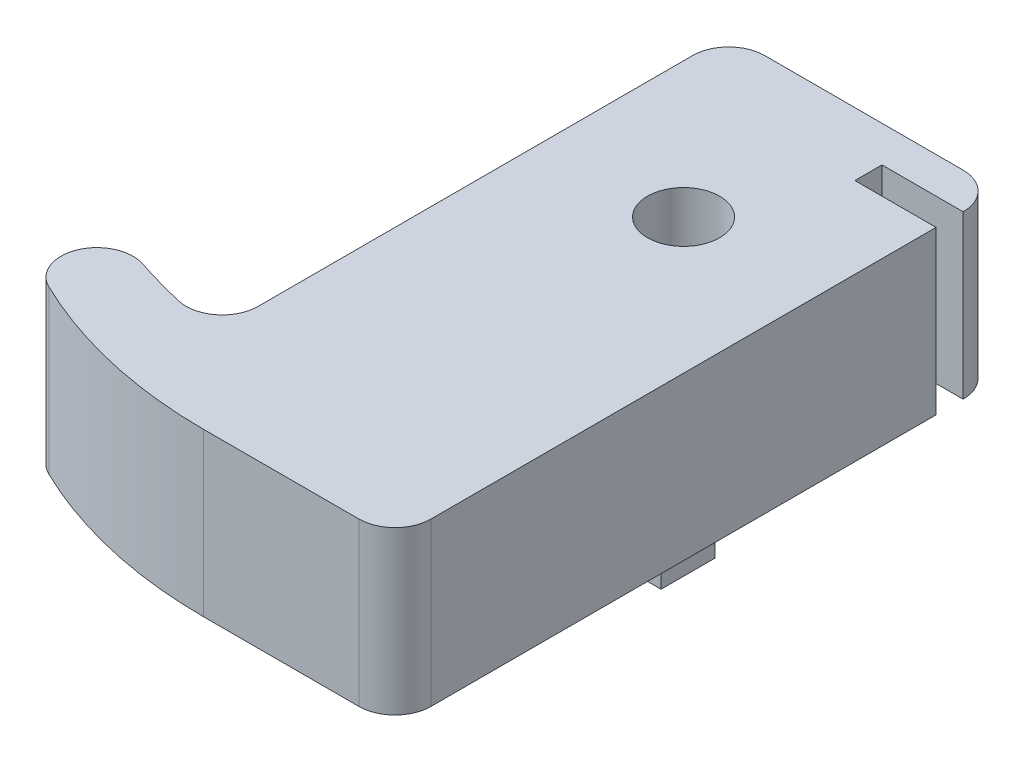
ISO-10303-21;
HEADER;
FILE_DESCRIPTION(('STEP AP214'),'2;1');
FILE_NAME('part.step','',(''),(''),'','','');
FILE_SCHEMA(('AUTOMOTIVE_DESIGN { 1 0 10303 214 1 1 1 1 }'));
ENDSEC;
DATA;
#1=APPLICATION_CONTEXT('core data for automotive mechanical design processes');
#2=APPLICATION_PROTOCOL_DEFINITION('international standard','automotive_design',2000,#1);
#3=PRODUCT_CONTEXT('',#1,'mechanical');
#4=PRODUCT('Part','Part','',(#3));
#5=PRODUCT_RELATED_PRODUCT_CATEGORY('part','',(#4));
#6=PRODUCT_DEFINITION_FORMATION('','',#4);
#7=PRODUCT_DEFINITION_CONTEXT('part definition',#1,'design');
#8=PRODUCT_DEFINITION('design','',#6,#7);
#9=PRODUCT_DEFINITION_SHAPE('','',#8);
#10=(LENGTH_UNIT() NAMED_UNIT(*) SI_UNIT(.MILLI.,.METRE.));
#11=(NAMED_UNIT(*) PLANE_ANGLE_UNIT() SI_UNIT($,.RADIAN.));
#12=(NAMED_UNIT(*) SI_UNIT($,.STERADIAN.) SOLID_ANGLE_UNIT());
#13=UNCERTAINTY_MEASURE_WITH_UNIT(LENGTH_MEASURE(1.E-05),#10,'distance_accuracy_value','');
#14=(GEOMETRIC_REPRESENTATION_CONTEXT(3) GLOBAL_UNCERTAINTY_ASSIGNED_CONTEXT((#13)) GLOBAL_UNIT_ASSIGNED_CONTEXT((#10,
#11,#12)) REPRESENTATION_CONTEXT('',''));
#15=CARTESIAN_POINT('',(0.,0.,0.));
#16=DIRECTION('',(0.,0.,1.));
#17=DIRECTION('',(1.,0.,0.));
#18=AXIS2_PLACEMENT_3D('',#15,#16,#17);
#19=CARTESIAN_POINT('',(0.,9.,-25.5));
#20=DIRECTION('',(0.,-1.,0.));
#21=DIRECTION('',(0.,0.,-1.));
#22=AXIS2_PLACEMENT_3D('',#19,#20,#21);
#23=CYLINDRICAL_SURFACE('',#22,25.5);
#24=CARTESIAN_POINT('',(0.,0.,-25.5));
#25=DIRECTION('',(0.,1.,0.));
#26=DIRECTION('',(0.,0.,1.));
#27=AXIS2_PLACEMENT_3D('',#24,#25,#26);
#28=CIRCLE('',#27,25.5);
#29=CARTESIAN_POINT('',(-11.1311224151511,0.,-2.55772213186054));
#30=VERTEX_POINT('',#29);
#31=CARTESIAN_POINT('',(0.,0.,0.));
#32=VERTEX_POINT('',#31);
#33=EDGE_CURVE('E335',#30,#32,#28,.T.);
#34=ORIENTED_EDGE('',*,*,#33,.F.);
#35=DIRECTION('',(0.,-1.,0.));
#36=VECTOR('',#35,1.);
#37=CARTESIAN_POINT('',(-11.1311224151511,9.,-2.55772213186054));
#38=LINE('',#37,#36);
#39=CARTESIAN_POINT('',(-11.1311224151511,-9.,-2.55772213186054));
#40=VERTEX_POINT('',#39);
#41=EDGE_CURVE('E234',#30,#40,#38,.T.);
#42=ORIENTED_EDGE('',*,*,#41,.T.);
#43=CARTESIAN_POINT('',(0.,-9.,-25.5));
#44=DIRECTION('',(0.,1.,0.));
#45=DIRECTION('',(0.,0.,-1.));
#46=AXIS2_PLACEMENT_3D('',#43,#44,#45);
#47=CIRCLE('',#46,25.5);
#48=CARTESIAN_POINT('',(0.,-9.,0.));
#49=VERTEX_POINT('',#48);
#50=EDGE_CURVE('E277',#40,#49,#47,.T.);
#51=ORIENTED_EDGE('',*,*,#50,.T.);
#52=DIRECTION('',(0.,-1.,0.));
#53=VECTOR('',#52,1.);
#54=CARTESIAN_POINT('',(0.,9.,0.));
#55=LINE('',#54,#53);
#56=EDGE_CURVE('E47',#32,#49,#55,.T.);
#57=ORIENTED_EDGE('',*,*,#56,.F.);
#58=EDGE_LOOP('',(#34,#42,#51,#57));
#59=FACE_BOUND('',#58,.T.);
#60=ADVANCED_FACE('F39',(#59),#23,.T.);
#61=CARTESIAN_POINT('',(8.61716411489142,9.,0.));
#62=DIRECTION('',(0.,0.,-1.));
#63=DIRECTION('',(-1.,0.,0.));
#64=AXIS2_PLACEMENT_3D('',#61,#62,#63);
#65=PLANE('',#64);
#66=DIRECTION('',(1.,0.,0.));
#67=VECTOR('',#66,1.);
#68=CARTESIAN_POINT('',(8.61716411489142,0.,0.));
#69=LINE('',#68,#67);
#70=CARTESIAN_POINT('',(8.61716411489143,0.,0.));
#71=VERTEX_POINT('',#70);
#72=EDGE_CURVE('E273',#32,#71,#69,.T.);
#73=ORIENTED_EDGE('',*,*,#72,.F.);
#74=ORIENTED_EDGE('',*,*,#56,.T.);
#75=DIRECTION('',(1.,0.,0.));
#76=VECTOR('',#75,1.);
#77=CARTESIAN_POINT('',(8.61716411489142,-9.,0.));
#78=LINE('',#77,#76);
#79=CARTESIAN_POINT('',(8.61716411489142,-9.,0.));
#80=VERTEX_POINT('',#79);
#81=EDGE_CURVE('E271',#49,#80,#78,.T.);
#82=ORIENTED_EDGE('',*,*,#81,.T.);
#83=DIRECTION('',(0.,-1.,0.));
#84=VECTOR('',#83,1.);
#85=CARTESIAN_POINT('',(8.61716411489142,9.,0.));
#86=LINE('',#85,#84);
#87=EDGE_CURVE('E260',#71,#80,#86,.T.);
#88=ORIENTED_EDGE('',*,*,#87,.F.);
#89=EDGE_LOOP('',(#73,#74,#82,#88));
#90=FACE_BOUND('',#89,.T.);
#91=ADVANCED_FACE('F268',(#90),#65,.F.);
#92=CARTESIAN_POINT('',(8.61716411489143,9.,-2.));
#93=DIRECTION('',(0.,-1.,0.));
#94=DIRECTION('',(0.,0.,-1.));
#95=AXIS2_PLACEMENT_3D('',#92,#93,#94);
#96=CYLINDRICAL_SURFACE('',#95,2.);
#97=CARTESIAN_POINT('',(8.61716411489143,0.,-2.));
#98=DIRECTION('',(0.,1.,0.));
#99=DIRECTION('',(0.,0.,1.));
#100=AXIS2_PLACEMENT_3D('',#97,#98,#99);
#101=CIRCLE('',#100,2.);
#102=CARTESIAN_POINT('',(10.6171641148914,0.,-2.00000000000002));
#103=VERTEX_POINT('',#102);
#104=EDGE_CURVE('E598',#71,#103,#101,.T.);
#105=ORIENTED_EDGE('',*,*,#104,.F.);
#106=ORIENTED_EDGE('',*,*,#87,.T.);
#107=CARTESIAN_POINT('',(8.61716411489143,-9.,-2.));
#108=DIRECTION('',(0.,1.,0.));
#109=DIRECTION('',(0.,0.,-1.));
#110=AXIS2_PLACEMENT_3D('',#107,#108,#109);
#111=CIRCLE('',#110,2.);
#112=CARTESIAN_POINT('',(10.6171641148914,-9.,-2.00000000000001));
#113=VERTEX_POINT('',#112);
#114=EDGE_CURVE('E289',#80,#113,#111,.T.);
#115=ORIENTED_EDGE('',*,*,#114,.T.);
#116=DIRECTION('',(0.,-1.,0.));
#117=VECTOR('',#116,1.);
#118=CARTESIAN_POINT('',(10.6171641148914,9.,-2.00000000000001));
#119=LINE('',#118,#117);
#120=EDGE_CURVE('E257',#103,#113,#119,.T.);
#121=ORIENTED_EDGE('',*,*,#120,.F.);
#122=EDGE_LOOP('',(#105,#106,#115,#121));
#123=FACE_BOUND('',#122,.T.);
#124=ADVANCED_FACE('F495',(#123),#96,.T.);
#125=CARTESIAN_POINT('',(10.6171641148914,9.,-31.5));
#126=DIRECTION('',(-1.,0.,0.));
#127=DIRECTION('',(0.,0.,1.));
#128=AXIS2_PLACEMENT_3D('',#125,#126,#127);
#129=PLANE('',#128);
#130=DIRECTION('',(0.,0.,-1.));
#131=VECTOR('',#130,1.);
#132=CARTESIAN_POINT('',(10.6171641148914,0.,-31.5));
#133=LINE('',#132,#131);
#134=CARTESIAN_POINT('',(10.6171641148914,0.,-30.));
#135=VERTEX_POINT('',#134);
#136=EDGE_CURVE('E595',#103,#135,#133,.T.);
#137=ORIENTED_EDGE('',*,*,#136,.F.);
#138=ORIENTED_EDGE('',*,*,#120,.T.);
#139=DIRECTION('',(0.,0.,-1.));
#140=VECTOR('',#139,1.);
#141=CARTESIAN_POINT('',(10.6171641148914,-9.,-31.5));
#142=LINE('',#141,#140);
#143=CARTESIAN_POINT('',(10.6171641148914,-9.,-30.));
#144=VERTEX_POINT('',#143);
#145=EDGE_CURVE('E293',#113,#144,#142,.T.);
#146=ORIENTED_EDGE('',*,*,#145,.T.);
#147=DIRECTION('',(0.,1.,0.));
#148=VECTOR('',#147,1.);
#149=CARTESIAN_POINT('',(10.6171641148914,-0.000999999999999265,-30.));
#150=LINE('',#149,#148);
#151=EDGE_CURVE('E225',#144,#135,#150,.T.);
#152=ORIENTED_EDGE('',*,*,#151,.T.);
#153=EDGE_LOOP('',(#137,#138,#146,#152));
#154=FACE_BOUND('',#153,.T.);
#155=ADVANCED_FACE('F499',(#154),#129,.F.);
#156=CARTESIAN_POINT('',(8.61716411489142,9.,-31.5));
#157=DIRECTION('',(0.,-1.,0.));
#158=DIRECTION('',(0.,0.,-1.));
#159=AXIS2_PLACEMENT_3D('',#156,#157,#158);
#160=CYLINDRICAL_SURFACE('',#159,2.);
#161=CARTESIAN_POINT('',(8.61716411489142,0.,-31.5));
#162=DIRECTION('',(0.,1.,0.));
#163=DIRECTION('',(0.,0.,1.));
#164=AXIS2_PLACEMENT_3D('',#161,#162,#163);
#165=CIRCLE('',#164,2.);
#166=CARTESIAN_POINT('',(10.6171641148914,0.,-31.5));
#167=VERTEX_POINT('',#166);
#168=CARTESIAN_POINT('',(8.61716411489142,0.,-33.5));
#169=VERTEX_POINT('',#168);
#170=EDGE_CURVE('E213',#167,#169,#165,.T.);
#171=ORIENTED_EDGE('',*,*,#170,.F.);
#172=DIRECTION('',(0.,-1.,0.));
#173=VECTOR('',#172,1.);
#174=CARTESIAN_POINT('',(10.6171641148914,9.,-31.5));
#175=LINE('',#174,#173);
#176=CARTESIAN_POINT('',(10.6171641148914,-9.,-31.5));
#177=VERTEX_POINT('',#176);
#178=EDGE_CURVE('E211',#167,#177,#175,.T.);
#179=ORIENTED_EDGE('',*,*,#178,.T.);
#180=CARTESIAN_POINT('',(8.61716411489142,-9.,-31.5));
#181=DIRECTION('',(0.,1.,0.));
#182=DIRECTION('',(0.,0.,-1.));
#183=AXIS2_PLACEMENT_3D('',#180,#181,#182);
#184=CIRCLE('',#183,2.);
#185=CARTESIAN_POINT('',(8.61716411489142,-9.,-33.5));
#186=VERTEX_POINT('',#185);
#187=EDGE_CURVE('E300',#177,#186,#184,.T.);
#188=ORIENTED_EDGE('',*,*,#187,.T.);
#189=DIRECTION('',(0.,-1.,0.));
#190=VECTOR('',#189,1.);
#191=CARTESIAN_POINT('',(8.61716411489142,9.,-33.5));
#192=LINE('',#191,#190);
#193=EDGE_CURVE('E252',#169,#186,#192,.T.);
#194=ORIENTED_EDGE('',*,*,#193,.F.);
#195=EDGE_LOOP('',(#171,#179,#188,#194));
#196=FACE_BOUND('',#195,.T.);
#197=ADVANCED_FACE('F505',(#196),#160,.T.);
#198=CARTESIAN_POINT('',(-2.38283588510858,9.,-33.5));
#199=DIRECTION('',(0.,0.,1.));
#200=DIRECTION('',(1.,0.,0.));
#201=AXIS2_PLACEMENT_3D('',#198,#199,#200);
#202=PLANE('',#201);
#203=DIRECTION('',(-1.,0.,0.));
#204=VECTOR('',#203,1.);
#205=CARTESIAN_POINT('',(-2.38283588510858,0.,-33.5));
#206=LINE('',#205,#204);
#207=CARTESIAN_POINT('',(-2.38283588510858,0.,-33.5));
#208=VERTEX_POINT('',#207);
#209=EDGE_CURVE('E352',#169,#208,#206,.T.);
#210=ORIENTED_EDGE('',*,*,#209,.F.);
#211=ORIENTED_EDGE('',*,*,#193,.T.);
#212=DIRECTION('',(-1.,0.,0.));
#213=VECTOR('',#212,1.);
#214=CARTESIAN_POINT('',(-2.38283588510858,-9.,-33.5));
#215=LINE('',#214,#213);
#216=CARTESIAN_POINT('',(-2.38283588510858,-9.,-33.5));
#217=VERTEX_POINT('',#216);
#218=EDGE_CURVE('E304',#186,#217,#215,.T.);
#219=ORIENTED_EDGE('',*,*,#218,.T.);
#220=DIRECTION('',(0.,-1.,0.));
#221=VECTOR('',#220,1.);
#222=CARTESIAN_POINT('',(-2.38283588510858,9.,-33.5));
#223=LINE('',#222,#221);
#224=EDGE_CURVE('E249',#208,#217,#223,.T.);
#225=ORIENTED_EDGE('',*,*,#224,.F.);
#226=EDGE_LOOP('',(#210,#211,#219,#225));
#227=FACE_BOUND('',#226,.T.);
#228=ADVANCED_FACE('F509',(#227),#202,.F.);
#229=CARTESIAN_POINT('',(-2.38283588510858,9.,-31.5));
#230=DIRECTION('',(0.,-1.,0.));
#231=DIRECTION('',(0.,0.,-1.));
#232=AXIS2_PLACEMENT_3D('',#229,#230,#231);
#233=CYLINDRICAL_SURFACE('',#232,2.);
#234=CARTESIAN_POINT('',(-2.38283588510858,0.,-31.5));
#235=DIRECTION('',(0.,1.,0.));
#236=DIRECTION('',(0.,0.,1.));
#237=AXIS2_PLACEMENT_3D('',#234,#235,#236);
#238=CIRCLE('',#237,2.);
#239=CARTESIAN_POINT('',(-4.38283588510858,0.,-31.5));
#240=VERTEX_POINT('',#239);
#241=EDGE_CURVE('E349',#208,#240,#238,.T.);
#242=ORIENTED_EDGE('',*,*,#241,.F.);
#243=ORIENTED_EDGE('',*,*,#224,.T.);
#244=CARTESIAN_POINT('',(-2.38283588510858,-9.,-31.5));
#245=DIRECTION('',(0.,1.,0.));
#246=DIRECTION('',(0.,0.,1.));
#247=AXIS2_PLACEMENT_3D('',#244,#245,#246);
#248=CIRCLE('',#247,2.);
#249=CARTESIAN_POINT('',(-4.38283588510858,-9.,-31.5));
#250=VERTEX_POINT('',#249);
#251=EDGE_CURVE('E308',#217,#250,#248,.T.);
#252=ORIENTED_EDGE('',*,*,#251,.T.);
#253=DIRECTION('',(0.,-1.,0.));
#254=VECTOR('',#253,1.);
#255=CARTESIAN_POINT('',(-4.38283588510858,9.,-31.5));
#256=LINE('',#255,#254);
#257=EDGE_CURVE('E246',#240,#250,#256,.T.);
#258=ORIENTED_EDGE('',*,*,#257,.F.);
#259=EDGE_LOOP('',(#242,#243,#252,#258));
#260=FACE_BOUND('',#259,.T.);
#261=ADVANCED_FACE('F513',(#260),#233,.T.);
#262=CARTESIAN_POINT('',(-4.38283588510857,9.,-7.42105961310574));
#263=DIRECTION('',(1.,0.,0.));
#264=DIRECTION('',(0.,0.,-1.));
#265=AXIS2_PLACEMENT_3D('',#262,#263,#264);
#266=PLANE('',#265);
#267=DIRECTION('',(0.,0.,1.));
#268=VECTOR('',#267,1.);
#269=CARTESIAN_POINT('',(-4.38283588510857,0.,-7.42105961310574));
#270=LINE('',#269,#268);
#271=CARTESIAN_POINT('',(-4.38283588510857,0.,-7.42105961310574));
#272=VERTEX_POINT('',#271);
#273=EDGE_CURVE('E346',#240,#272,#270,.T.);
#274=ORIENTED_EDGE('',*,*,#273,.F.);
#275=ORIENTED_EDGE('',*,*,#257,.T.);
#276=DIRECTION('',(0.,0.,1.));
#277=VECTOR('',#276,1.);
#278=CARTESIAN_POINT('',(-4.38283588510857,-9.,-7.42105961310574));
#279=LINE('',#278,#277);
#280=CARTESIAN_POINT('',(-4.38283588510857,-9.,-7.42105961310574));
#281=VERTEX_POINT('',#280);
#282=EDGE_CURVE('E312',#250,#281,#279,.T.);
#283=ORIENTED_EDGE('',*,*,#282,.T.);
#284=DIRECTION('',(0.,-1.,0.));
#285=VECTOR('',#284,1.);
#286=CARTESIAN_POINT('',(-4.38283588510857,9.,-7.42105961310574));
#287=LINE('',#286,#285);
#288=EDGE_CURVE('E243',#272,#281,#287,.T.);
#289=ORIENTED_EDGE('',*,*,#288,.F.);
#290=EDGE_LOOP('',(#274,#275,#283,#289));
#291=FACE_BOUND('',#290,.T.);
#292=ADVANCED_FACE('F517',(#291),#266,.F.);
#293=CARTESIAN_POINT('',(-6.38283588510857,9.,-7.42105961310574));
#294=DIRECTION('',(0.,-1.,0.));
#295=DIRECTION('',(0.,0.,-1.));
#296=AXIS2_PLACEMENT_3D('',#293,#294,#295);
#297=CYLINDRICAL_SURFACE('',#296,2.);
#298=CARTESIAN_POINT('',(-6.38283588510857,0.,-7.42105961310574));
#299=DIRECTION('',(0.,1.,0.));
#300=DIRECTION('',(0.,0.,1.));
#301=AXIS2_PLACEMENT_3D('',#298,#299,#300);
#302=CIRCLE('',#301,2.);
#303=CARTESIAN_POINT('',(-6.83639449681552,0.,-5.47316726860966));
#304=VERTEX_POINT('',#303);
#305=EDGE_CURVE('E339',#272,#304,#302,.F.);
#306=ORIENTED_EDGE('',*,*,#305,.F.);
#307=ORIENTED_EDGE('',*,*,#288,.T.);
#308=CARTESIAN_POINT('',(-6.38283588510857,-9.,-7.42105961310574));
#309=DIRECTION('',(0.,-1.,0.));
#310=DIRECTION('',(0.,0.,1.));
#311=AXIS2_PLACEMENT_3D('',#308,#309,#310);
#312=CIRCLE('',#311,2.);
#313=CARTESIAN_POINT('',(-6.83639449681552,-9.,-5.47316726860966));
#314=VERTEX_POINT('',#313);
#315=EDGE_CURVE('E316',#281,#314,#312,.T.);
#316=ORIENTED_EDGE('',*,*,#315,.T.);
#317=DIRECTION('',(0.,-1.,0.));
#318=VECTOR('',#317,1.);
#319=CARTESIAN_POINT('',(-6.83639449681552,9.,-5.47316726860966));
#320=LINE('',#319,#318);
#321=EDGE_CURVE('E240',#304,#314,#320,.T.);
#322=ORIENTED_EDGE('',*,*,#321,.F.);
#323=EDGE_LOOP('',(#306,#307,#316,#322));
#324=FACE_BOUND('',#323,.T.);
#325=ADVANCED_FACE('F521',(#324),#297,.F.);
#326=CARTESIAN_POINT('',(0.571114599262993,9.,-37.2861014464734));
#327=DIRECTION('',(0.,-1.,0.));
#328=DIRECTION('',(0.,0.,-1.));
#329=AXIS2_PLACEMENT_3D('',#326,#327,#328);
#330=CYLINDRICAL_SURFACE('',#329,32.6639552414213);
#331=CARTESIAN_POINT('',(0.571114599262993,0.,-37.2861014464734));
#332=DIRECTION('',(0.,1.,0.));
#333=DIRECTION('',(0.,0.,1.));
#334=AXIS2_PLACEMENT_3D('',#331,#332,#333);
#335=CIRCLE('',#334,32.6639552414213);
#336=CARTESIAN_POINT('',(-9.63328234827252,0.,-6.25701420642225));
#337=VERTEX_POINT('',#336);
#338=EDGE_CURVE('E334',#304,#337,#335,.F.);
#339=ORIENTED_EDGE('',*,*,#338,.F.);
#340=ORIENTED_EDGE('',*,*,#321,.T.);
#341=CARTESIAN_POINT('',(0.571114599262993,-9.,-37.2861014464734));
#342=DIRECTION('',(0.,-1.,0.));
#343=DIRECTION('',(0.,0.,-1.));
#344=AXIS2_PLACEMENT_3D('',#341,#342,#343);
#345=CIRCLE('',#344,32.6639552414213);
#346=CARTESIAN_POINT('',(-9.63328234827252,-9.,-6.25701420642225));
#347=VERTEX_POINT('',#346);
#348=EDGE_CURVE('E228',#314,#347,#345,.T.);
#349=ORIENTED_EDGE('',*,*,#348,.T.);
#350=DIRECTION('',(0.,-1.,0.));
#351=VECTOR('',#350,1.);
#352=CARTESIAN_POINT('',(-9.63328234827252,9.,-6.25701420642225));
#353=LINE('',#352,#351);
#354=EDGE_CURVE('E237',#337,#347,#353,.T.);
#355=ORIENTED_EDGE('',*,*,#354,.F.);
#356=EDGE_LOOP('',(#339,#340,#349,#355));
#357=FACE_BOUND('',#356,.T.);
#358=ADVANCED_FACE('F326',(#357),#330,.F.);
#359=CARTESIAN_POINT('',(-10.2580932061196,9.,-4.35711647445971));
#360=DIRECTION('',(0.,-1.,0.));
#361=DIRECTION('',(0.,0.,-1.));
#362=AXIS2_PLACEMENT_3D('',#359,#360,#361);
#363=CYLINDRICAL_SURFACE('',#362,2.);
#364=CARTESIAN_POINT('',(-10.2580932061196,0.,-4.35711647445971));
#365=DIRECTION('',(0.,1.,0.));
#366=DIRECTION('',(0.,0.,1.));
#367=AXIS2_PLACEMENT_3D('',#364,#365,#366);
#368=CIRCLE('',#367,2.);
#369=EDGE_CURVE('E332',#337,#30,#368,.T.);
#370=ORIENTED_EDGE('',*,*,#369,.F.);
#371=ORIENTED_EDGE('',*,*,#354,.T.);
#372=CARTESIAN_POINT('',(-10.2580932061196,-9.,-4.35711647445971));
#373=DIRECTION('',(0.,1.,0.));
#374=DIRECTION('',(0.,0.,-1.));
#375=AXIS2_PLACEMENT_3D('',#372,#373,#374);
#376=CIRCLE('',#375,2.);
#377=EDGE_CURVE('E221',#347,#40,#376,.T.);
#378=ORIENTED_EDGE('',*,*,#377,.T.);
#379=ORIENTED_EDGE('',*,*,#41,.F.);
#380=EDGE_LOOP('',(#370,#371,#378,#379));
#381=FACE_BOUND('',#380,.T.);
#382=ADVANCED_FACE('F331',(#381),#363,.T.);
#383=CARTESIAN_POINT('',(3.11716411489142,9.,-23.5));
#384=DIRECTION('',(0.,-1.,0.));
#385=DIRECTION('',(0.,0.,-1.));
#386=AXIS2_PLACEMENT_3D('',#383,#384,#385);
#387=CYLINDRICAL_SURFACE('',#386,2.);
#388=CARTESIAN_POINT('',(3.11716411489142,-9.,-23.5));
#389=DIRECTION('',(0.,1.,0.));
#390=DIRECTION('',(0.,0.,1.));
#391=AXIS2_PLACEMENT_3D('',#388,#389,#390);
#392=CIRCLE('',#391,2.);
#393=CARTESIAN_POINT('',(3.11716411489142,-9.,-21.5));
#394=VERTEX_POINT('',#393);
#395=EDGE_CURVE('E282',#394,#394,#392,.T.);
#396=ORIENTED_EDGE('',*,*,#395,.F.);
#397=EDGE_LOOP('',(#396));
#398=FACE_BOUND('',#397,.T.);
#399=CARTESIAN_POINT('',(3.11716411489142,0.,-23.5));
#400=DIRECTION('',(0.,1.,0.));
#401=DIRECTION('',(0.,0.,1.));
#402=AXIS2_PLACEMENT_3D('',#399,#400,#401);
#403=CIRCLE('',#402,2.);
#404=CARTESIAN_POINT('',(3.11716411489142,0.,-21.5));
#405=VERTEX_POINT('',#404);
#406=EDGE_CURVE('E355',#405,#405,#403,.T.);
#407=ORIENTED_EDGE('',*,*,#406,.T.);
#408=EDGE_LOOP('',(#407));
#409=FACE_BOUND('',#408,.T.);
#410=ADVANCED_FACE('F476',(#398,#409),#387,.F.);
#411=CARTESIAN_POINT('',(-2.38283588510857,-0.000999999999999265,-31.5));
#412=DIRECTION('',(0.,0.,-1.));
#413=DIRECTION('',(-1.,0.,0.));
#414=AXIS2_PLACEMENT_3D('',#411,#412,#413);
#415=PLANE('',#414);
#416=DIRECTION('',(1.,0.,0.));
#417=VECTOR('',#416,1.);
#418=CARTESIAN_POINT('',(-2.38283588510857,0.,-31.5));
#419=LINE('',#418,#417);
#420=CARTESIAN_POINT('',(6.11716411489142,0.,-31.5));
#421=VERTEX_POINT('',#420);
#422=EDGE_CURVE('E200',#421,#167,#419,.T.);
#423=ORIENTED_EDGE('',*,*,#422,.F.);
#424=DIRECTION('',(0.,-1.,0.));
#425=VECTOR('',#424,1.);
#426=CARTESIAN_POINT('',(6.11716411489142,4.,-31.5));
#427=LINE('',#426,#425);
#428=CARTESIAN_POINT('',(6.11716411489142,-4.,-31.5));
#429=VERTEX_POINT('',#428);
#430=EDGE_CURVE('E208',#421,#429,#427,.T.);
#431=ORIENTED_EDGE('',*,*,#430,.T.);
#432=DIRECTION('',(1.,0.,0.));
#433=VECTOR('',#432,1.);
#434=CARTESIAN_POINT('',(6.11716411489142,-4.,-31.5));
#435=LINE('',#434,#433);
#436=CARTESIAN_POINT('',(-2.38283588510857,-4.,-31.5));
#437=VERTEX_POINT('',#436);
#438=EDGE_CURVE('E363',#437,#429,#435,.T.);
#439=ORIENTED_EDGE('',*,*,#438,.F.);
#440=DIRECTION('',(0.,-1.,0.));
#441=VECTOR('',#440,1.);
#442=CARTESIAN_POINT('',(-2.38283588510857,0.000999999999999265,-31.5));
#443=LINE('',#442,#441);
#444=CARTESIAN_POINT('',(-2.38283588510857,-9.,-31.5));
#445=VERTEX_POINT('',#444);
#446=EDGE_CURVE('E383',#437,#445,#443,.T.);
#447=ORIENTED_EDGE('',*,*,#446,.T.);
#448=DIRECTION('',(-1.,0.,0.));
#449=VECTOR('',#448,1.);
#450=CARTESIAN_POINT('',(-2.38283588510857,-9.,-31.5));
#451=LINE('',#450,#449);
#452=EDGE_CURVE('E378',#177,#445,#451,.T.);
#453=ORIENTED_EDGE('',*,*,#452,.F.);
#454=ORIENTED_EDGE('',*,*,#178,.F.);
#455=EDGE_LOOP('',(#423,#431,#439,#447,#453,#454));
#456=FACE_BOUND('',#455,.T.);
#457=ADVANCED_FACE('F207',(#456),#415,.F.);
#458=CARTESIAN_POINT('',(-2.38283588510857,-0.000999999999999265,-30.));
#459=DIRECTION('',(0.,0.,1.));
#460=DIRECTION('',(1.,0.,0.));
#461=AXIS2_PLACEMENT_3D('',#458,#459,#460);
#462=PLANE('',#461);
#463=DIRECTION('',(-1.,0.,0.));
#464=VECTOR('',#463,1.);
#465=CARTESIAN_POINT('',(-2.38283588510857,0.,-30.));
#466=LINE('',#465,#464);
#467=CARTESIAN_POINT('',(6.11716411489142,0.,-30.));
#468=VERTEX_POINT('',#467);
#469=EDGE_CURVE('E54',#135,#468,#466,.T.);
#470=ORIENTED_EDGE('',*,*,#469,.F.);
#471=ORIENTED_EDGE('',*,*,#151,.F.);
#472=DIRECTION('',(1.,0.,0.));
#473=VECTOR('',#472,1.);
#474=CARTESIAN_POINT('',(-2.38283588510857,-9.,-30.));
#475=LINE('',#474,#473);
#476=CARTESIAN_POINT('',(-2.38283588510857,-9.,-30.));
#477=VERTEX_POINT('',#476);
#478=EDGE_CURVE('E374',#477,#144,#475,.T.);
#479=ORIENTED_EDGE('',*,*,#478,.F.);
#480=DIRECTION('',(0.,-1.,0.));
#481=VECTOR('',#480,1.);
#482=CARTESIAN_POINT('',(-2.38283588510857,0.000999999999999265,-30.));
#483=LINE('',#482,#481);
#484=CARTESIAN_POINT('',(-2.38283588510857,-4.,-30.));
#485=VERTEX_POINT('',#484);
#486=EDGE_CURVE('E382',#485,#477,#483,.T.);
#487=ORIENTED_EDGE('',*,*,#486,.F.);
#488=DIRECTION('',(-1.,0.,0.));
#489=VECTOR('',#488,1.);
#490=CARTESIAN_POINT('',(-2.38283588510857,-4.,-30.));
#491=LINE('',#490,#489);
#492=CARTESIAN_POINT('',(6.11716411489142,-4.,-30.));
#493=VERTEX_POINT('',#492);
#494=EDGE_CURVE('E368',#493,#485,#491,.T.);
#495=ORIENTED_EDGE('',*,*,#494,.F.);
#496=DIRECTION('',(0.,-1.,0.));
#497=VECTOR('',#496,1.);
#498=CARTESIAN_POINT('',(6.11716411489142,4.,-30.));
#499=LINE('',#498,#497);
#500=EDGE_CURVE('E220',#468,#493,#499,.T.);
#501=ORIENTED_EDGE('',*,*,#500,.F.);
#502=EDGE_LOOP('',(#470,#471,#479,#487,#495,#501));
#503=FACE_BOUND('',#502,.T.);
#504=ADVANCED_FACE('F530',(#503),#462,.F.);
#505=CARTESIAN_POINT('',(6.11716411489142,4.,-31.5));
#506=DIRECTION('',(1.,0.,0.));
#507=DIRECTION('',(0.,0.,-1.));
#508=AXIS2_PLACEMENT_3D('',#505,#506,#507);
#509=PLANE('',#508);
#510=ORIENTED_EDGE('',*,*,#430,.F.);
#511=DIRECTION('',(0.,0.,1.));
#512=VECTOR('',#511,1.);
#513=CARTESIAN_POINT('',(6.11716411489142,0.,-31.5));
#514=LINE('',#513,#512);
#515=EDGE_CURVE('E11',#421,#468,#514,.T.);
#516=ORIENTED_EDGE('',*,*,#515,.T.);
#517=ORIENTED_EDGE('',*,*,#500,.T.);
#518=DIRECTION('',(0.,0.,1.));
#519=VECTOR('',#518,1.);
#520=CARTESIAN_POINT('',(6.11716411489142,-4.,-31.5));
#521=LINE('',#520,#519);
#522=EDGE_CURVE('E217',#429,#493,#521,.T.);
#523=ORIENTED_EDGE('',*,*,#522,.F.);
#524=EDGE_LOOP('',(#510,#516,#517,#523));
#525=FACE_BOUND('',#524,.T.);
#526=ADVANCED_FACE('F215',(#525),#509,.T.);
#527=CARTESIAN_POINT('',(0.,-9.,-25.5));
#528=DIRECTION('',(0.,1.,0.));
#529=DIRECTION('',(0.,0.,-1.));
#530=AXIS2_PLACEMENT_3D('',#527,#528,#529);
#531=PLANE('',#530);
#532=DIRECTION('',(0.,0.,1.));
#533=VECTOR('',#532,1.);
#534=CARTESIAN_POINT('',(-3.63283588510858,-9.,-18.5));
#535=LINE('',#534,#533);
#536=CARTESIAN_POINT('',(-3.63283588510858,-9.,-18.5));
#537=VERTEX_POINT('',#536);
#538=CARTESIAN_POINT('',(-3.63283588510858,-9.,-15.5));
#539=VERTEX_POINT('',#538);
#540=EDGE_CURVE('E429',#537,#539,#535,.T.);
#541=ORIENTED_EDGE('',*,*,#540,.T.);
#542=DIRECTION('',(1.,0.,0.));
#543=VECTOR('',#542,1.);
#544=CARTESIAN_POINT('',(-3.63283588510858,-9.,-15.5));
#545=LINE('',#544,#543);
#546=CARTESIAN_POINT('',(-1.13283588510858,-9.,-15.5));
#547=VERTEX_POINT('',#546);
#548=EDGE_CURVE('E450',#539,#547,#545,.T.);
#549=ORIENTED_EDGE('',*,*,#548,.T.);
#550=DIRECTION('',(0.,0.,-1.));
#551=VECTOR('',#550,1.);
#552=CARTESIAN_POINT('',(-1.13283588510858,-9.,-18.5));
#553=LINE('',#552,#551);
#554=CARTESIAN_POINT('',(-1.13283588510858,-9.,-18.5));
#555=VERTEX_POINT('',#554);
#556=EDGE_CURVE('E454',#547,#555,#553,.T.);
#557=ORIENTED_EDGE('',*,*,#556,.T.);
#558=DIRECTION('',(-1.,0.,0.));
#559=VECTOR('',#558,1.);
#560=CARTESIAN_POINT('',(-3.63283588510858,-9.,-18.5));
#561=LINE('',#560,#559);
#562=EDGE_CURVE('E435',#555,#537,#561,.T.);
#563=ORIENTED_EDGE('',*,*,#562,.T.);
#564=EDGE_LOOP('',(#541,#549,#557,#563));
#565=FACE_BOUND('',#564,.T.);
#566=DIRECTION('',(0.,0.,1.));
#567=VECTOR('',#566,1.);
#568=CARTESIAN_POINT('',(-2.38283588510857,-9.,-31.5));
#569=LINE('',#568,#567);
#570=EDGE_CURVE('E371',#445,#477,#569,.T.);
#571=ORIENTED_EDGE('',*,*,#570,.T.);
#572=ORIENTED_EDGE('',*,*,#478,.T.);
#573=ORIENTED_EDGE('',*,*,#145,.F.);
#574=ORIENTED_EDGE('',*,*,#114,.F.);
#575=ORIENTED_EDGE('',*,*,#81,.F.);
#576=ORIENTED_EDGE('',*,*,#50,.F.);
#577=ORIENTED_EDGE('',*,*,#377,.F.);
#578=ORIENTED_EDGE('',*,*,#348,.F.);
#579=ORIENTED_EDGE('',*,*,#315,.F.);
#580=ORIENTED_EDGE('',*,*,#282,.F.);
#581=ORIENTED_EDGE('',*,*,#251,.F.);
#582=ORIENTED_EDGE('',*,*,#218,.F.);
#583=ORIENTED_EDGE('',*,*,#187,.F.);
#584=ORIENTED_EDGE('',*,*,#452,.T.);
#585=EDGE_LOOP('',(#571,#572,#573,#574,#575,#576,#577,#578,#579,#580,#581,#582,#583,#584));
#586=FACE_BOUND('',#585,.T.);
#587=ORIENTED_EDGE('',*,*,#395,.T.);
#588=EDGE_LOOP('',(#587));
#589=FACE_BOUND('',#588,.T.);
#590=DIRECTION('',(-1.,0.,0.));
#591=VECTOR('',#590,1.);
#592=CARTESIAN_POINT('',(9.86716411489142,-9.,-18.5));
#593=LINE('',#592,#591);
#594=CARTESIAN_POINT('',(9.86716411489142,-9.,-18.5));
#595=VERTEX_POINT('',#594);
#596=CARTESIAN_POINT('',(7.36716411489142,-9.,-18.5));
#597=VERTEX_POINT('',#596);
#598=EDGE_CURVE('E386',#595,#597,#593,.T.);
#599=ORIENTED_EDGE('',*,*,#598,.T.);
#600=DIRECTION('',(0.,0.,1.));
#601=VECTOR('',#600,1.);
#602=CARTESIAN_POINT('',(7.36716411489142,-9.,-18.5));
#603=LINE('',#602,#601);
#604=CARTESIAN_POINT('',(7.36716411489142,-9.,-15.5));
#605=VERTEX_POINT('',#604);
#606=EDGE_CURVE('E408',#597,#605,#603,.T.);
#607=ORIENTED_EDGE('',*,*,#606,.T.);
#608=DIRECTION('',(1.,0.,0.));
#609=VECTOR('',#608,1.);
#610=CARTESIAN_POINT('',(9.86716411489142,-9.,-15.5));
#611=LINE('',#610,#609);
#612=CARTESIAN_POINT('',(9.86716411489142,-9.,-15.5));
#613=VERTEX_POINT('',#612);
#614=EDGE_CURVE('E412',#605,#613,#611,.T.);
#615=ORIENTED_EDGE('',*,*,#614,.T.);
#616=DIRECTION('',(0.,0.,-1.));
#617=VECTOR('',#616,1.);
#618=CARTESIAN_POINT('',(9.86716411489142,-9.,-18.5));
#619=LINE('',#618,#617);
#620=EDGE_CURVE('E393',#613,#595,#619,.T.);
#621=ORIENTED_EDGE('',*,*,#620,.T.);
#622=EDGE_LOOP('',(#599,#607,#615,#621));
#623=FACE_BOUND('',#622,.T.);
#624=ADVANCED_FACE('F285',(#565,#586,#589,#623),#531,.F.);
#625=CARTESIAN_POINT('',(-3.63283588510858,-10.5,-18.5));
#626=DIRECTION('',(1.,0.,0.));
#627=DIRECTION('',(0.,0.,-1.));
#628=AXIS2_PLACEMENT_3D('',#625,#626,#627);
#629=PLANE('',#628);
#630=ORIENTED_EDGE('',*,*,#540,.F.);
#631=DIRECTION('',(0.,1.,0.));
#632=VECTOR('',#631,1.);
#633=CARTESIAN_POINT('',(-3.63283588510858,-10.5,-18.5));
#634=LINE('',#633,#632);
#635=CARTESIAN_POINT('',(-3.63283588510858,-10.5,-18.5));
#636=VERTEX_POINT('',#635);
#637=EDGE_CURVE('E446',#636,#537,#634,.T.);
#638=ORIENTED_EDGE('',*,*,#637,.F.);
#639=DIRECTION('',(0.,0.,1.));
#640=VECTOR('',#639,1.);
#641=CARTESIAN_POINT('',(-3.63283588510858,-10.5,-18.5));
#642=LINE('',#641,#640);
#643=CARTESIAN_POINT('',(-3.63283588510858,-10.5,-15.5));
#644=VERTEX_POINT('',#643);
#645=EDGE_CURVE('E430',#636,#644,#642,.T.);
#646=ORIENTED_EDGE('',*,*,#645,.T.);
#647=DIRECTION('',(0.,1.,0.));
#648=VECTOR('',#647,1.);
#649=CARTESIAN_POINT('',(-3.63283588510858,-10.5,-15.5));
#650=LINE('',#649,#648);
#651=EDGE_CURVE('E469',#644,#539,#650,.T.);
#652=ORIENTED_EDGE('',*,*,#651,.T.);
#653=EDGE_LOOP('',(#630,#638,#646,#652));
#654=FACE_BOUND('',#653,.T.);
#655=ADVANCED_FACE('F540',(#654),#629,.F.);
#656=CARTESIAN_POINT('',(-3.63283588510858,-10.5,-15.5));
#657=DIRECTION('',(0.,0.,-1.));
#658=DIRECTION('',(-1.,0.,0.));
#659=AXIS2_PLACEMENT_3D('',#656,#657,#658);
#660=PLANE('',#659);
#661=ORIENTED_EDGE('',*,*,#548,.F.);
#662=ORIENTED_EDGE('',*,*,#651,.F.);
#663=DIRECTION('',(1.,0.,0.));
#664=VECTOR('',#663,1.);
#665=CARTESIAN_POINT('',(-3.63283588510858,-10.5,-15.5));
#666=LINE('',#665,#664);
#667=CARTESIAN_POINT('',(-1.13283588510858,-10.5,-15.5));
#668=VERTEX_POINT('',#667);
#669=EDGE_CURVE('E434',#644,#668,#666,.T.);
#670=ORIENTED_EDGE('',*,*,#669,.T.);
#671=DIRECTION('',(0.,1.,0.));
#672=VECTOR('',#671,1.);
#673=CARTESIAN_POINT('',(-1.13283588510858,-10.5,-15.5));
#674=LINE('',#673,#672);
#675=EDGE_CURVE('E466',#668,#547,#674,.T.);
#676=ORIENTED_EDGE('',*,*,#675,.T.);
#677=EDGE_LOOP('',(#661,#662,#670,#676));
#678=FACE_BOUND('',#677,.T.);
#679=ADVANCED_FACE('F544',(#678),#660,.F.);
#680=CARTESIAN_POINT('',(-1.13283588510858,-10.5,-18.5));
#681=DIRECTION('',(-1.,0.,0.));
#682=DIRECTION('',(0.,0.,1.));
#683=AXIS2_PLACEMENT_3D('',#680,#681,#682);
#684=PLANE('',#683);
#685=ORIENTED_EDGE('',*,*,#556,.F.);
#686=ORIENTED_EDGE('',*,*,#675,.F.);
#687=DIRECTION('',(0.,0.,-1.));
#688=VECTOR('',#687,1.);
#689=CARTESIAN_POINT('',(-1.13283588510858,-10.5,-18.5));
#690=LINE('',#689,#688);
#691=CARTESIAN_POINT('',(-1.13283588510858,-10.5,-18.5));
#692=VERTEX_POINT('',#691);
#693=EDGE_CURVE('E439',#668,#692,#690,.T.);
#694=ORIENTED_EDGE('',*,*,#693,.T.);
#695=DIRECTION('',(0.,1.,0.));
#696=VECTOR('',#695,1.);
#697=CARTESIAN_POINT('',(-1.13283588510858,-10.5,-18.5));
#698=LINE('',#697,#696);
#699=EDGE_CURVE('E463',#692,#555,#698,.T.);
#700=ORIENTED_EDGE('',*,*,#699,.T.);
#701=EDGE_LOOP('',(#685,#686,#694,#700));
#702=FACE_BOUND('',#701,.T.);
#703=ADVANCED_FACE('F548',(#702),#684,.F.);
#704=CARTESIAN_POINT('',(-3.63283588510858,-10.5,-18.5));
#705=DIRECTION('',(0.,0.,1.));
#706=DIRECTION('',(1.,0.,0.));
#707=AXIS2_PLACEMENT_3D('',#704,#705,#706);
#708=PLANE('',#707);
#709=ORIENTED_EDGE('',*,*,#562,.F.);
#710=ORIENTED_EDGE('',*,*,#699,.F.);
#711=DIRECTION('',(-1.,0.,0.));
#712=VECTOR('',#711,1.);
#713=CARTESIAN_POINT('',(-3.63283588510858,-10.5,-18.5));
#714=LINE('',#713,#712);
#715=EDGE_CURVE('E443',#692,#636,#714,.T.);
#716=ORIENTED_EDGE('',*,*,#715,.T.);
#717=ORIENTED_EDGE('',*,*,#637,.T.);
#718=EDGE_LOOP('',(#709,#710,#716,#717));
#719=FACE_BOUND('',#718,.T.);
#720=ADVANCED_FACE('F552',(#719),#708,.F.);
#721=CARTESIAN_POINT('',(0.,-10.5,0.));
#722=DIRECTION('',(0.,-1.,0.));
#723=DIRECTION('',(0.,0.,1.));
#724=AXIS2_PLACEMENT_3D('',#721,#722,#723);
#725=PLANE('',#724);
#726=ORIENTED_EDGE('',*,*,#645,.F.);
#727=ORIENTED_EDGE('',*,*,#715,.F.);
#728=ORIENTED_EDGE('',*,*,#693,.F.);
#729=ORIENTED_EDGE('',*,*,#669,.F.);
#730=EDGE_LOOP('',(#726,#727,#728,#729));
#731=FACE_BOUND('',#730,.T.);
#732=ADVANCED_FACE('F556',(#731),#725,.T.);
#733=CARTESIAN_POINT('',(9.86716411489142,-10.5,-18.5));
#734=DIRECTION('',(0.,0.,1.));
#735=DIRECTION('',(1.,0.,0.));
#736=AXIS2_PLACEMENT_3D('',#733,#734,#735);
#737=PLANE('',#736);
#738=ORIENTED_EDGE('',*,*,#598,.F.);
#739=DIRECTION('',(0.,1.,0.));
#740=VECTOR('',#739,1.);
#741=CARTESIAN_POINT('',(9.86716411489142,-10.5,-18.5));
#742=LINE('',#741,#740);
#743=CARTESIAN_POINT('',(9.86716411489142,-10.5,-18.5));
#744=VERTEX_POINT('',#743);
#745=EDGE_CURVE('E404',#744,#595,#742,.T.);
#746=ORIENTED_EDGE('',*,*,#745,.F.);
#747=DIRECTION('',(-1.,0.,0.));
#748=VECTOR('',#747,1.);
#749=CARTESIAN_POINT('',(9.86716411489142,-10.5,-18.5));
#750=LINE('',#749,#748);
#751=CARTESIAN_POINT('',(7.36716411489142,-10.5,-18.5));
#752=VERTEX_POINT('',#751);
#753=EDGE_CURVE('E389',#744,#752,#750,.T.);
#754=ORIENTED_EDGE('',*,*,#753,.T.);
#755=DIRECTION('',(0.,1.,0.));
#756=VECTOR('',#755,1.);
#757=CARTESIAN_POINT('',(7.36716411489142,-10.5,-18.5));
#758=LINE('',#757,#756);
#759=EDGE_CURVE('E61',#752,#597,#758,.T.);
#760=ORIENTED_EDGE('',*,*,#759,.T.);
#761=EDGE_LOOP('',(#738,#746,#754,#760));
#762=FACE_BOUND('',#761,.T.);
#763=ADVANCED_FACE('F560',(#762),#737,.F.);
#764=CARTESIAN_POINT('',(7.36716411489142,-10.5,-18.5));
#765=DIRECTION('',(1.,0.,0.));
#766=DIRECTION('',(0.,0.,-1.));
#767=AXIS2_PLACEMENT_3D('',#764,#765,#766);
#768=PLANE('',#767);
#769=ORIENTED_EDGE('',*,*,#606,.F.);
#770=ORIENTED_EDGE('',*,*,#759,.F.);
#771=DIRECTION('',(0.,0.,1.));
#772=VECTOR('',#771,1.);
#773=CARTESIAN_POINT('',(7.36716411489142,-10.5,-18.5));
#774=LINE('',#773,#772);
#775=CARTESIAN_POINT('',(7.36716411489142,-10.5,-15.5));
#776=VERTEX_POINT('',#775);
#777=EDGE_CURVE('E392',#752,#776,#774,.T.);
#778=ORIENTED_EDGE('',*,*,#777,.T.);
#779=DIRECTION('',(0.,1.,0.));
#780=VECTOR('',#779,1.);
#781=CARTESIAN_POINT('',(7.36716411489142,-10.5,-15.5));
#782=LINE('',#781,#780);
#783=EDGE_CURVE('E424',#776,#605,#782,.T.);
#784=ORIENTED_EDGE('',*,*,#783,.T.);
#785=EDGE_LOOP('',(#769,#770,#778,#784));
#786=FACE_BOUND('',#785,.T.);
#787=ADVANCED_FACE('F564',(#786),#768,.F.);
#788=CARTESIAN_POINT('',(9.86716411489142,-10.5,-15.5));
#789=DIRECTION('',(0.,0.,-1.));
#790=DIRECTION('',(-1.,0.,0.));
#791=AXIS2_PLACEMENT_3D('',#788,#789,#790);
#792=PLANE('',#791);
#793=ORIENTED_EDGE('',*,*,#614,.F.);
#794=ORIENTED_EDGE('',*,*,#783,.F.);
#795=DIRECTION('',(1.,0.,0.));
#796=VECTOR('',#795,1.);
#797=CARTESIAN_POINT('',(9.86716411489142,-10.5,-15.5));
#798=LINE('',#797,#796);
#799=CARTESIAN_POINT('',(9.86716411489142,-10.5,-15.5));
#800=VERTEX_POINT('',#799);
#801=EDGE_CURVE('E397',#776,#800,#798,.T.);
#802=ORIENTED_EDGE('',*,*,#801,.T.);
#803=DIRECTION('',(0.,1.,0.));
#804=VECTOR('',#803,1.);
#805=CARTESIAN_POINT('',(9.86716411489142,-10.5,-15.5));
#806=LINE('',#805,#804);
#807=EDGE_CURVE('E421',#800,#613,#806,.T.);
#808=ORIENTED_EDGE('',*,*,#807,.T.);
#809=EDGE_LOOP('',(#793,#794,#802,#808));
#810=FACE_BOUND('',#809,.T.);
#811=ADVANCED_FACE('F567',(#810),#792,.F.);
#812=CARTESIAN_POINT('',(9.86716411489142,-10.5,-18.5));
#813=DIRECTION('',(-1.,0.,0.));
#814=DIRECTION('',(0.,0.,1.));
#815=AXIS2_PLACEMENT_3D('',#812,#813,#814);
#816=PLANE('',#815);
#817=ORIENTED_EDGE('',*,*,#620,.F.);
#818=ORIENTED_EDGE('',*,*,#807,.F.);
#819=DIRECTION('',(0.,0.,-1.));
#820=VECTOR('',#819,1.);
#821=CARTESIAN_POINT('',(9.86716411489142,-10.5,-18.5));
#822=LINE('',#821,#820);
#823=EDGE_CURVE('E401',#800,#744,#822,.T.);
#824=ORIENTED_EDGE('',*,*,#823,.T.);
#825=ORIENTED_EDGE('',*,*,#745,.T.);
#826=EDGE_LOOP('',(#817,#818,#824,#825));
#827=FACE_BOUND('',#826,.T.);
#828=ADVANCED_FACE('F571',(#827),#816,.F.);
#829=CARTESIAN_POINT('',(0.,-10.5,0.));
#830=DIRECTION('',(0.,-1.,0.));
#831=DIRECTION('',(0.,0.,1.));
#832=AXIS2_PLACEMENT_3D('',#829,#830,#831);
#833=PLANE('',#832);
#834=ORIENTED_EDGE('',*,*,#753,.F.);
#835=ORIENTED_EDGE('',*,*,#823,.F.);
#836=ORIENTED_EDGE('',*,*,#801,.F.);
#837=ORIENTED_EDGE('',*,*,#777,.F.);
#838=EDGE_LOOP('',(#834,#835,#836,#837));
#839=FACE_BOUND('',#838,.T.);
#840=ADVANCED_FACE('F575',(#839),#833,.T.);
#841=CARTESIAN_POINT('',(-2.38283588510857,0.000999999999999265,-31.5));
#842=DIRECTION('',(-1.,0.,0.));
#843=DIRECTION('',(0.,0.,1.));
#844=AXIS2_PLACEMENT_3D('',#841,#842,#843);
#845=PLANE('',#844);
#846=ORIENTED_EDGE('',*,*,#486,.T.);
#847=ORIENTED_EDGE('',*,*,#570,.F.);
#848=ORIENTED_EDGE('',*,*,#446,.F.);
#849=DIRECTION('',(0.,0.,-1.));
#850=VECTOR('',#849,1.);
#851=CARTESIAN_POINT('',(-2.38283588510857,-4.,-31.5));
#852=LINE('',#851,#850);
#853=EDGE_CURVE('E359',#485,#437,#852,.T.);
#854=ORIENTED_EDGE('',*,*,#853,.F.);
#855=EDGE_LOOP('',(#846,#847,#848,#854));
#856=FACE_BOUND('',#855,.T.);
#857=ADVANCED_FACE('F488',(#856),#845,.F.);
#858=CARTESIAN_POINT('',(0.,-4.,0.));
#859=DIRECTION('',(0.,-1.,0.));
#860=DIRECTION('',(0.,0.,1.));
#861=AXIS2_PLACEMENT_3D('',#858,#859,#860);
#862=PLANE('',#861);
#863=ORIENTED_EDGE('',*,*,#853,.T.);
#864=ORIENTED_EDGE('',*,*,#438,.T.);
#865=ORIENTED_EDGE('',*,*,#522,.T.);
#866=ORIENTED_EDGE('',*,*,#494,.T.);
#867=EDGE_LOOP('',(#863,#864,#865,#866));
#868=FACE_BOUND('',#867,.T.);
#869=ADVANCED_FACE('F483',(#868),#862,.T.);
#870=CARTESIAN_POINT('',(0.,0.,0.));
#871=DIRECTION('',(0.,1.,0.));
#872=DIRECTION('',(0.,0.,1.));
#873=AXIS2_PLACEMENT_3D('',#870,#871,#872);
#874=PLANE('',#873);
#875=ORIENTED_EDGE('',*,*,#406,.F.);
#876=EDGE_LOOP('',(#875));
#877=FACE_BOUND('',#876,.T.);
#878=ORIENTED_EDGE('',*,*,#209,.T.);
#879=ORIENTED_EDGE('',*,*,#241,.T.);
#880=ORIENTED_EDGE('',*,*,#273,.T.);
#881=ORIENTED_EDGE('',*,*,#305,.T.);
#882=ORIENTED_EDGE('',*,*,#338,.T.);
#883=ORIENTED_EDGE('',*,*,#369,.T.);
#884=ORIENTED_EDGE('',*,*,#33,.T.);
#885=ORIENTED_EDGE('',*,*,#72,.T.);
#886=ORIENTED_EDGE('',*,*,#104,.T.);
#887=ORIENTED_EDGE('',*,*,#136,.T.);
#888=ORIENTED_EDGE('',*,*,#469,.T.);
#889=ORIENTED_EDGE('',*,*,#515,.F.);
#890=ORIENTED_EDGE('',*,*,#422,.T.);
#891=ORIENTED_EDGE('',*,*,#170,.T.);
#892=EDGE_LOOP('',(#878,#879,#880,#881,#882,#883,#884,#885,#886,#887,#888,#889,#890,#891));
#893=FACE_BOUND('',#892,.T.);
#894=ADVANCED_FACE('F199',(#877,#893),#874,.T.);
#895=CLOSED_SHELL('',(#60,#91,#124,#155,#197,#228,#261,#292,#325,#358,#382,#410,#457,#504,#526,
#624,#655,#679,#703,#720,#732,#763,#787,#811,#828,#840,#857,#869,#894));
#896=MANIFOLD_SOLID_BREP('B2',#895);
#897=ADVANCED_BREP_SHAPE_REPRESENTATION('',(#18,#896),#14);
#898=SHAPE_DEFINITION_REPRESENTATION(#9,#897);
ENDSEC;
END-ISO-10303-21;
